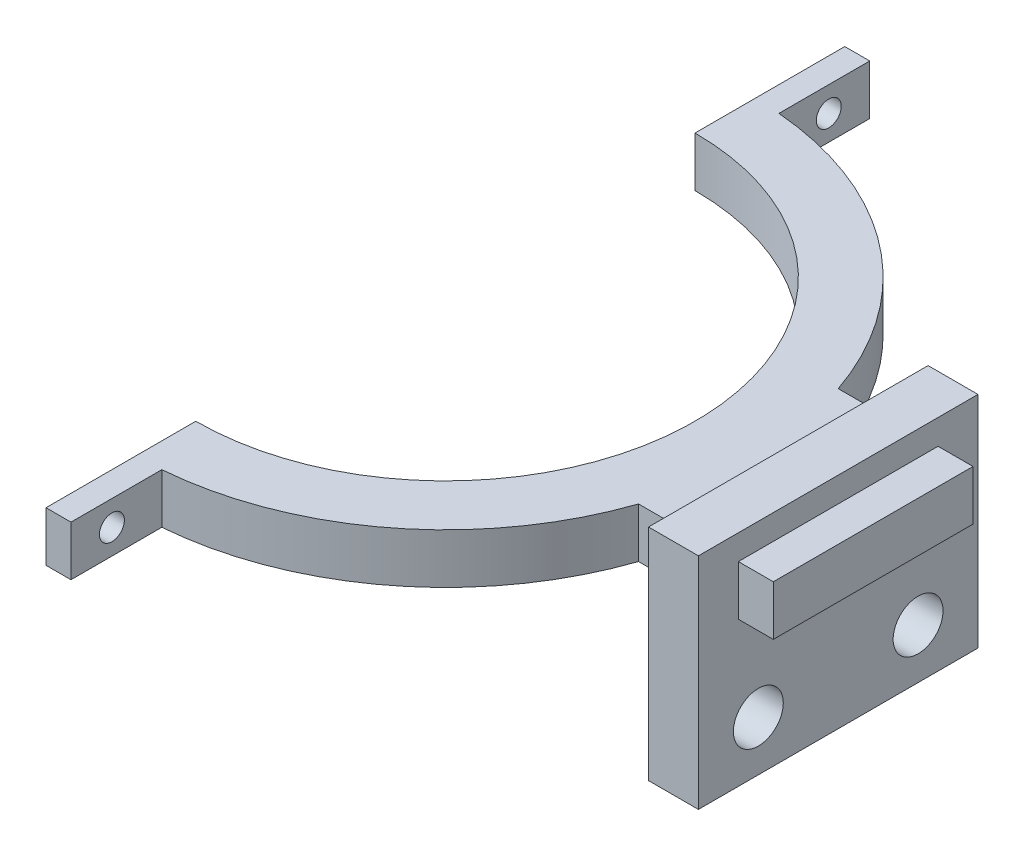
ISO-10303-21;
HEADER;
FILE_DESCRIPTION(('STEP AP214'),'2;1');
FILE_NAME('part.step','',(''),(''),'','','');
FILE_SCHEMA(('AUTOMOTIVE_DESIGN { 1 0 10303 214 1 1 1 1 }'));
ENDSEC;
DATA;
#1=APPLICATION_CONTEXT('core data for automotive mechanical design processes');
#2=APPLICATION_PROTOCOL_DEFINITION('international standard','automotive_design',2000,#1);
#3=PRODUCT_CONTEXT('',#1,'mechanical');
#4=PRODUCT('Part','Part','',(#3));
#5=PRODUCT_RELATED_PRODUCT_CATEGORY('part','',(#4));
#6=PRODUCT_DEFINITION_FORMATION('','',#4);
#7=PRODUCT_DEFINITION_CONTEXT('part definition',#1,'design');
#8=PRODUCT_DEFINITION('design','',#6,#7);
#9=PRODUCT_DEFINITION_SHAPE('','',#8);
#10=(LENGTH_UNIT() NAMED_UNIT(*) SI_UNIT(.MILLI.,.METRE.));
#11=(NAMED_UNIT(*) PLANE_ANGLE_UNIT() SI_UNIT($,.RADIAN.));
#12=(NAMED_UNIT(*) SI_UNIT($,.STERADIAN.) SOLID_ANGLE_UNIT());
#13=UNCERTAINTY_MEASURE_WITH_UNIT(LENGTH_MEASURE(1.E-05),#10,'distance_accuracy_value','');
#14=(GEOMETRIC_REPRESENTATION_CONTEXT(3) GLOBAL_UNCERTAINTY_ASSIGNED_CONTEXT((#13)) GLOBAL_UNIT_ASSIGNED_CONTEXT((#10,
#11,#12)) REPRESENTATION_CONTEXT('',''));
#15=CARTESIAN_POINT('',(0.,0.,0.));
#16=DIRECTION('',(0.,0.,1.));
#17=DIRECTION('',(1.,0.,0.));
#18=AXIS2_PLACEMENT_3D('',#15,#16,#17);
#19=CARTESIAN_POINT('',(39.3428015022424,5.,0.));
#20=DIRECTION('',(1.,0.,0.));
#21=DIRECTION('',(0.,0.,-1.));
#22=AXIS2_PLACEMENT_3D('',#19,#20,#21);
#23=PLANE('',#22);
#24=DIRECTION('',(0.,-1.,0.));
#25=VECTOR('',#24,1.);
#26=CARTESIAN_POINT('',(39.3428015022424,0.,-14.));
#27=LINE('',#26,#25);
#28=CARTESIAN_POINT('',(39.3428015022424,7.5,-14.));
#29=VERTEX_POINT('',#28);
#30=CARTESIAN_POINT('',(39.3428015022424,-14.5,-14.));
#31=VERTEX_POINT('',#30);
#32=EDGE_CURVE('E213',#29,#31,#27,.T.);
#33=ORIENTED_EDGE('',*,*,#32,.F.);
#34=DIRECTION('',(0.,0.,-1.));
#35=VECTOR('',#34,1.);
#36=CARTESIAN_POINT('',(39.3428015022424,7.5,0.));
#37=LINE('',#36,#35);
#38=CARTESIAN_POINT('',(39.3428015022424,7.5,14.));
#39=VERTEX_POINT('',#38);
#40=EDGE_CURVE('E216',#39,#29,#37,.T.);
#41=ORIENTED_EDGE('',*,*,#40,.F.);
#42=DIRECTION('',(0.,-1.,0.));
#43=VECTOR('',#42,1.);
#44=CARTESIAN_POINT('',(39.3428015022424,0.,14.));
#45=LINE('',#44,#43);
#46=CARTESIAN_POINT('',(39.3428015022424,-14.5,14.));
#47=VERTEX_POINT('',#46);
#48=EDGE_CURVE('E240',#39,#47,#45,.T.);
#49=ORIENTED_EDGE('',*,*,#48,.T.);
#50=DIRECTION('',(0.,0.,-1.));
#51=VECTOR('',#50,1.);
#52=CARTESIAN_POINT('',(39.3428015022424,-14.5,0.));
#53=LINE('',#52,#51);
#54=EDGE_CURVE('E243',#47,#31,#53,.T.);
#55=ORIENTED_EDGE('',*,*,#54,.T.);
#56=EDGE_LOOP('',(#33,#41,#49,#55));
#57=FACE_BOUND('',#56,.T.);
#58=CARTESIAN_POINT('',(39.3428015022424,-9.5,-8.));
#59=DIRECTION('',(1.,0.,0.));
#60=DIRECTION('',(0.,0.,-1.));
#61=AXIS2_PLACEMENT_3D('',#58,#59,#60);
#62=CIRCLE('',#61,2.5);
#63=CARTESIAN_POINT('',(39.3428015022424,-9.5,-10.5));
#64=VERTEX_POINT('',#63);
#65=EDGE_CURVE('E246',#64,#64,#62,.T.);
#66=ORIENTED_EDGE('',*,*,#65,.F.);
#67=EDGE_LOOP('',(#66));
#68=FACE_BOUND('',#67,.T.);
#69=CARTESIAN_POINT('',(39.3428015022424,-9.5,8.));
#70=DIRECTION('',(1.,0.,0.));
#71=DIRECTION('',(0.,0.,-1.));
#72=AXIS2_PLACEMENT_3D('',#69,#70,#71);
#73=CIRCLE('',#72,2.5);
#74=CARTESIAN_POINT('',(39.3428015022424,-9.5,5.5));
#75=VERTEX_POINT('',#74);
#76=EDGE_CURVE('E224',#75,#75,#73,.F.);
#77=ORIENTED_EDGE('',*,*,#76,.T.);
#78=EDGE_LOOP('',(#77));
#79=FACE_BOUND('',#78,.T.);
#80=DIRECTION('',(0.,0.,1.));
#81=VECTOR('',#80,1.);
#82=CARTESIAN_POINT('',(39.3428015022424,5.,10.));
#83=LINE('',#82,#81);
#84=CARTESIAN_POINT('',(39.3428015022424,5.,-10.));
#85=VERTEX_POINT('',#84);
#86=CARTESIAN_POINT('',(39.3428015022424,5.,10.));
#87=VERTEX_POINT('',#86);
#88=EDGE_CURVE('E483',#85,#87,#83,.T.);
#89=ORIENTED_EDGE('',*,*,#88,.F.);
#90=DIRECTION('',(0.,1.,0.));
#91=VECTOR('',#90,1.);
#92=CARTESIAN_POINT('',(39.3428015022424,5.,-10.));
#93=LINE('',#92,#91);
#94=CARTESIAN_POINT('',(39.3428015022424,0.,-10.));
#95=VERTEX_POINT('',#94);
#96=EDGE_CURVE('E211',#95,#85,#93,.T.);
#97=ORIENTED_EDGE('',*,*,#96,.F.);
#98=DIRECTION('',(0.,0.,-1.));
#99=VECTOR('',#98,1.);
#100=CARTESIAN_POINT('',(39.3428015022424,0.,10.));
#101=LINE('',#100,#99);
#102=CARTESIAN_POINT('',(39.3428015022424,0.,10.));
#103=VERTEX_POINT('',#102);
#104=EDGE_CURVE('E207',#103,#95,#101,.T.);
#105=ORIENTED_EDGE('',*,*,#104,.F.);
#106=DIRECTION('',(0.,-1.,0.));
#107=VECTOR('',#106,1.);
#108=CARTESIAN_POINT('',(39.3428015022424,5.,10.));
#109=LINE('',#108,#107);
#110=EDGE_CURVE('E485',#87,#103,#109,.T.);
#111=ORIENTED_EDGE('',*,*,#110,.F.);
#112=EDGE_LOOP('',(#89,#97,#105,#111));
#113=FACE_BOUND('',#112,.T.);
#114=ADVANCED_FACE('F50',(#57,#68,#79,#113),#23,.T.);
#115=CARTESIAN_POINT('',(0.,5.,-9.99999999999999));
#116=DIRECTION('',(0.,0.,1.));
#117=DIRECTION('',(1.,0.,0.));
#118=AXIS2_PLACEMENT_3D('',#115,#116,#117);
#119=PLANE('',#118);
#120=DIRECTION('',(0.,1.,0.));
#121=VECTOR('',#120,1.);
#122=CARTESIAN_POINT('',(34.3428015022424,5.,-10.));
#123=LINE('',#122,#121);
#124=CARTESIAN_POINT('',(34.3428015022424,0.,-10.));
#125=VERTEX_POINT('',#124);
#126=CARTESIAN_POINT('',(34.3428015022424,5.,-10.));
#127=VERTEX_POINT('',#126);
#128=EDGE_CURVE('E260',#125,#127,#123,.T.);
#129=ORIENTED_EDGE('',*,*,#128,.F.);
#130=DIRECTION('',(-1.,0.,0.));
#131=VECTOR('',#130,1.);
#132=CARTESIAN_POINT('',(0.,0.,-9.99999999999999));
#133=LINE('',#132,#131);
#134=CARTESIAN_POINT('',(29.3428015022424,0.,-10.));
#135=VERTEX_POINT('',#134);
#136=EDGE_CURVE('E265',#125,#135,#133,.T.);
#137=ORIENTED_EDGE('',*,*,#136,.T.);
#138=DIRECTION('',(0.,-1.,0.));
#139=VECTOR('',#138,1.);
#140=CARTESIAN_POINT('',(29.3428015022424,5.,-10.));
#141=LINE('',#140,#139);
#142=CARTESIAN_POINT('',(29.3428015022424,5.,-10.));
#143=VERTEX_POINT('',#142);
#144=EDGE_CURVE('E58',#143,#135,#141,.T.);
#145=ORIENTED_EDGE('',*,*,#144,.F.);
#146=DIRECTION('',(-1.,0.,0.));
#147=VECTOR('',#146,1.);
#148=CARTESIAN_POINT('',(0.,5.,-9.99999999999999));
#149=LINE('',#148,#147);
#150=EDGE_CURVE('E266',#127,#143,#149,.T.);
#151=ORIENTED_EDGE('',*,*,#150,.F.);
#152=EDGE_LOOP('',(#129,#137,#145,#151));
#153=FACE_BOUND('',#152,.T.);
#154=ADVANCED_FACE('F52',(#153),#119,.F.);
#155=CARTESIAN_POINT('',(0.,5.,10.));
#156=DIRECTION('',(0.,0.,1.));
#157=DIRECTION('',(1.,0.,0.));
#158=AXIS2_PLACEMENT_3D('',#155,#156,#157);
#159=PLANE('',#158);
#160=DIRECTION('',(-1.,0.,0.));
#161=VECTOR('',#160,1.);
#162=CARTESIAN_POINT('',(0.,0.,10.));
#163=LINE('',#162,#161);
#164=CARTESIAN_POINT('',(34.3428015022424,0.,10.));
#165=VERTEX_POINT('',#164);
#166=CARTESIAN_POINT('',(29.3428015022424,0.,10.));
#167=VERTEX_POINT('',#166);
#168=EDGE_CURVE('E269',#165,#167,#163,.T.);
#169=ORIENTED_EDGE('',*,*,#168,.F.);
#170=DIRECTION('',(0.,1.,0.));
#171=VECTOR('',#170,1.);
#172=CARTESIAN_POINT('',(34.3428015022424,5.,10.));
#173=LINE('',#172,#171);
#174=CARTESIAN_POINT('',(34.3428015022424,5.,10.));
#175=VERTEX_POINT('',#174);
#176=EDGE_CURVE('E73',#165,#175,#173,.T.);
#177=ORIENTED_EDGE('',*,*,#176,.T.);
#178=DIRECTION('',(-1.,0.,0.));
#179=VECTOR('',#178,1.);
#180=CARTESIAN_POINT('',(0.,5.,10.));
#181=LINE('',#180,#179);
#182=CARTESIAN_POINT('',(29.3428015022424,5.,10.));
#183=VERTEX_POINT('',#182);
#184=EDGE_CURVE('E292',#175,#183,#181,.T.);
#185=ORIENTED_EDGE('',*,*,#184,.T.);
#186=DIRECTION('',(0.,-1.,0.));
#187=VECTOR('',#186,1.);
#188=CARTESIAN_POINT('',(29.3428015022424,5.,10.));
#189=LINE('',#188,#187);
#190=EDGE_CURVE('E294',#183,#167,#189,.T.);
#191=ORIENTED_EDGE('',*,*,#190,.T.);
#192=EDGE_LOOP('',(#169,#177,#185,#191));
#193=FACE_BOUND('',#192,.T.);
#194=ADVANCED_FACE('F395',(#193),#159,.T.);
#195=CARTESIAN_POINT('',(0.,5.,0.));
#196=DIRECTION('',(0.,1.,0.));
#197=DIRECTION('',(0.,0.,1.));
#198=AXIS2_PLACEMENT_3D('',#195,#196,#197);
#199=PLANE('',#198);
#200=ORIENTED_EDGE('',*,*,#184,.F.);
#201=DIRECTION('',(0.,0.,-1.));
#202=VECTOR('',#201,1.);
#203=CARTESIAN_POINT('',(34.3428015022424,5.,0.));
#204=LINE('',#203,#202);
#205=EDGE_CURVE('E263',#175,#127,#204,.T.);
#206=ORIENTED_EDGE('',*,*,#205,.T.);
#207=ORIENTED_EDGE('',*,*,#150,.T.);
#208=CARTESIAN_POINT('',(0.,5.,0.));
#209=DIRECTION('',(0.,1.,0.));
#210=DIRECTION('',(0.,0.,1.));
#211=AXIS2_PLACEMENT_3D('',#208,#209,#210);
#212=CIRCLE('',#211,31.);
#213=CARTESIAN_POINT('',(2.5,5.,-30.8990291109608));
#214=VERTEX_POINT('',#213);
#215=EDGE_CURVE('E268',#143,#214,#212,.T.);
#216=ORIENTED_EDGE('',*,*,#215,.T.);
#217=DIRECTION('',(0.,0.,1.));
#218=VECTOR('',#217,1.);
#219=CARTESIAN_POINT('',(2.5,5.,0.));
#220=LINE('',#219,#218);
#221=CARTESIAN_POINT('',(2.5,5.,-40.));
#222=VERTEX_POINT('',#221);
#223=EDGE_CURVE('E271',#222,#214,#220,.T.);
#224=ORIENTED_EDGE('',*,*,#223,.F.);
#225=DIRECTION('',(1.,0.,0.));
#226=VECTOR('',#225,1.);
#227=CARTESIAN_POINT('',(0.,5.,-40.));
#228=LINE('',#227,#226);
#229=CARTESIAN_POINT('',(0.,5.,-40.));
#230=VERTEX_POINT('',#229);
#231=EDGE_CURVE('E274',#230,#222,#228,.T.);
#232=ORIENTED_EDGE('',*,*,#231,.F.);
#233=DIRECTION('',(0.,0.,-1.));
#234=VECTOR('',#233,1.);
#235=CARTESIAN_POINT('',(0.,5.,0.));
#236=LINE('',#235,#234);
#237=CARTESIAN_POINT('',(0.,5.,-25.));
#238=VERTEX_POINT('',#237);
#239=EDGE_CURVE('E277',#238,#230,#236,.T.);
#240=ORIENTED_EDGE('',*,*,#239,.F.);
#241=CARTESIAN_POINT('',(0.,5.,0.));
#242=DIRECTION('',(0.,1.,0.));
#243=DIRECTION('',(0.,0.,1.));
#244=AXIS2_PLACEMENT_3D('',#241,#242,#243);
#245=CIRCLE('',#244,25.);
#246=CARTESIAN_POINT('',(0.,5.,25.));
#247=VERTEX_POINT('',#246);
#248=EDGE_CURVE('E280',#247,#238,#245,.T.);
#249=ORIENTED_EDGE('',*,*,#248,.F.);
#250=DIRECTION('',(0.,0.,1.));
#251=VECTOR('',#250,1.);
#252=CARTESIAN_POINT('',(0.,5.,0.));
#253=LINE('',#252,#251);
#254=CARTESIAN_POINT('',(0.,5.,40.));
#255=VERTEX_POINT('',#254);
#256=EDGE_CURVE('E283',#247,#255,#253,.T.);
#257=ORIENTED_EDGE('',*,*,#256,.T.);
#258=DIRECTION('',(1.,0.,0.));
#259=VECTOR('',#258,1.);
#260=CARTESIAN_POINT('',(0.,5.,40.));
#261=LINE('',#260,#259);
#262=CARTESIAN_POINT('',(2.5,5.,40.));
#263=VERTEX_POINT('',#262);
#264=EDGE_CURVE('E285',#255,#263,#261,.T.);
#265=ORIENTED_EDGE('',*,*,#264,.T.);
#266=DIRECTION('',(0.,0.,-1.));
#267=VECTOR('',#266,1.);
#268=CARTESIAN_POINT('',(2.5,5.,0.));
#269=LINE('',#268,#267);
#270=CARTESIAN_POINT('',(2.5,5.,30.8990291109608));
#271=VERTEX_POINT('',#270);
#272=EDGE_CURVE('E287',#263,#271,#269,.T.);
#273=ORIENTED_EDGE('',*,*,#272,.T.);
#274=CARTESIAN_POINT('',(0.,5.,0.));
#275=DIRECTION('',(0.,1.,0.));
#276=DIRECTION('',(0.,0.,1.));
#277=AXIS2_PLACEMENT_3D('',#274,#275,#276);
#278=CIRCLE('',#277,31.);
#279=EDGE_CURVE('E289',#271,#183,#278,.T.);
#280=ORIENTED_EDGE('',*,*,#279,.T.);
#281=EDGE_LOOP('',(#200,#206,#207,#216,#224,#232,#240,#249,#257,#265,#273,#280));
#282=FACE_BOUND('',#281,.T.);
#283=ADVANCED_FACE('F360',(#282),#199,.T.);
#284=CARTESIAN_POINT('',(0.,0.,0.));
#285=DIRECTION('',(0.,1.,0.));
#286=DIRECTION('',(0.,0.,1.));
#287=AXIS2_PLACEMENT_3D('',#284,#285,#286);
#288=PLANE('',#287);
#289=DIRECTION('',(0.,0.,-1.));
#290=VECTOR('',#289,1.);
#291=CARTESIAN_POINT('',(34.3428015022424,0.,0.));
#292=LINE('',#291,#290);
#293=EDGE_CURVE('E13',#165,#125,#292,.T.);
#294=ORIENTED_EDGE('',*,*,#293,.F.);
#295=ORIENTED_EDGE('',*,*,#168,.T.);
#296=CARTESIAN_POINT('',(0.,0.,0.));
#297=DIRECTION('',(0.,1.,0.));
#298=DIRECTION('',(0.,0.,1.));
#299=AXIS2_PLACEMENT_3D('',#296,#297,#298);
#300=CIRCLE('',#299,31.);
#301=CARTESIAN_POINT('',(2.5,0.,30.8990291109608));
#302=VERTEX_POINT('',#301);
#303=EDGE_CURVE('E317',#302,#167,#300,.T.);
#304=ORIENTED_EDGE('',*,*,#303,.F.);
#305=DIRECTION('',(0.,0.,-1.));
#306=VECTOR('',#305,1.);
#307=CARTESIAN_POINT('',(2.5,0.,0.));
#308=LINE('',#307,#306);
#309=CARTESIAN_POINT('',(2.5,0.,40.));
#310=VERTEX_POINT('',#309);
#311=EDGE_CURVE('E315',#310,#302,#308,.T.);
#312=ORIENTED_EDGE('',*,*,#311,.F.);
#313=DIRECTION('',(1.,0.,0.));
#314=VECTOR('',#313,1.);
#315=CARTESIAN_POINT('',(0.,0.,40.));
#316=LINE('',#315,#314);
#317=CARTESIAN_POINT('',(0.,0.,40.));
#318=VERTEX_POINT('',#317);
#319=EDGE_CURVE('E313',#318,#310,#316,.T.);
#320=ORIENTED_EDGE('',*,*,#319,.F.);
#321=DIRECTION('',(0.,0.,1.));
#322=VECTOR('',#321,1.);
#323=CARTESIAN_POINT('',(0.,0.,0.));
#324=LINE('',#323,#322);
#325=CARTESIAN_POINT('',(0.,0.,25.));
#326=VERTEX_POINT('',#325);
#327=EDGE_CURVE('E311',#326,#318,#324,.T.);
#328=ORIENTED_EDGE('',*,*,#327,.F.);
#329=CARTESIAN_POINT('',(0.,0.,0.));
#330=DIRECTION('',(0.,1.,0.));
#331=DIRECTION('',(0.,0.,1.));
#332=AXIS2_PLACEMENT_3D('',#329,#330,#331);
#333=CIRCLE('',#332,25.);
#334=CARTESIAN_POINT('',(0.,0.,-25.));
#335=VERTEX_POINT('',#334);
#336=EDGE_CURVE('E308',#326,#335,#333,.T.);
#337=ORIENTED_EDGE('',*,*,#336,.T.);
#338=DIRECTION('',(0.,0.,-1.));
#339=VECTOR('',#338,1.);
#340=CARTESIAN_POINT('',(0.,0.,0.));
#341=LINE('',#340,#339);
#342=CARTESIAN_POINT('',(0.,0.,-40.));
#343=VERTEX_POINT('',#342);
#344=EDGE_CURVE('E305',#335,#343,#341,.T.);
#345=ORIENTED_EDGE('',*,*,#344,.T.);
#346=DIRECTION('',(1.,0.,0.));
#347=VECTOR('',#346,1.);
#348=CARTESIAN_POINT('',(0.,0.,-40.));
#349=LINE('',#348,#347);
#350=CARTESIAN_POINT('',(2.5,0.,-40.));
#351=VERTEX_POINT('',#350);
#352=EDGE_CURVE('E302',#343,#351,#349,.T.);
#353=ORIENTED_EDGE('',*,*,#352,.T.);
#354=DIRECTION('',(0.,0.,1.));
#355=VECTOR('',#354,1.);
#356=CARTESIAN_POINT('',(2.5,0.,0.));
#357=LINE('',#356,#355);
#358=CARTESIAN_POINT('',(2.5,0.,-30.8990291109608));
#359=VERTEX_POINT('',#358);
#360=EDGE_CURVE('E299',#351,#359,#357,.T.);
#361=ORIENTED_EDGE('',*,*,#360,.T.);
#362=CARTESIAN_POINT('',(0.,0.,0.));
#363=DIRECTION('',(0.,1.,0.));
#364=DIRECTION('',(0.,0.,1.));
#365=AXIS2_PLACEMENT_3D('',#362,#363,#364);
#366=CIRCLE('',#365,31.);
#367=EDGE_CURVE('E296',#135,#359,#366,.T.);
#368=ORIENTED_EDGE('',*,*,#367,.F.);
#369=ORIENTED_EDGE('',*,*,#136,.F.);
#370=EDGE_LOOP('',(#294,#295,#304,#312,#320,#328,#337,#345,#353,#361,#368,#369));
#371=FACE_BOUND('',#370,.T.);
#372=ADVANCED_FACE('F352',(#371),#288,.F.);
#373=CARTESIAN_POINT('',(0.,5.,0.));
#374=DIRECTION('',(0.,-1.,0.));
#375=DIRECTION('',(0.,0.,-1.));
#376=AXIS2_PLACEMENT_3D('',#373,#374,#375);
#377=CYLINDRICAL_SURFACE('',#376,31.);
#378=ORIENTED_EDGE('',*,*,#367,.T.);
#379=DIRECTION('',(0.,-1.,0.));
#380=VECTOR('',#379,1.);
#381=CARTESIAN_POINT('',(2.5,5.,-30.8990291109608));
#382=LINE('',#381,#380);
#383=EDGE_CURVE('E340',#214,#359,#382,.T.);
#384=ORIENTED_EDGE('',*,*,#383,.F.);
#385=ORIENTED_EDGE('',*,*,#215,.F.);
#386=ORIENTED_EDGE('',*,*,#144,.T.);
#387=EDGE_LOOP('',(#378,#384,#385,#386));
#388=FACE_BOUND('',#387,.T.);
#389=ADVANCED_FACE('F345',(#388),#377,.T.);
#390=CARTESIAN_POINT('',(2.5,5.,0.));
#391=DIRECTION('',(1.,0.,0.));
#392=DIRECTION('',(0.,0.,-1.));
#393=AXIS2_PLACEMENT_3D('',#390,#391,#392);
#394=PLANE('',#393);
#395=CARTESIAN_POINT('',(2.5,2.5,-35.8990291109608));
#396=DIRECTION('',(1.,0.,0.));
#397=DIRECTION('',(0.,0.,1.));
#398=AXIS2_PLACEMENT_3D('',#395,#396,#397);
#399=CIRCLE('',#398,1.25);
#400=CARTESIAN_POINT('',(2.5,2.5,-34.6490291109608));
#401=VERTEX_POINT('',#400);
#402=EDGE_CURVE('E474',#401,#401,#399,.T.);
#403=ORIENTED_EDGE('',*,*,#402,.F.);
#404=EDGE_LOOP('',(#403));
#405=FACE_BOUND('',#404,.T.);
#406=ORIENTED_EDGE('',*,*,#360,.F.);
#407=DIRECTION('',(0.,-1.,0.));
#408=VECTOR('',#407,1.);
#409=CARTESIAN_POINT('',(2.5,5.,-40.));
#410=LINE('',#409,#408);
#411=EDGE_CURVE('E338',#222,#351,#410,.T.);
#412=ORIENTED_EDGE('',*,*,#411,.F.);
#413=ORIENTED_EDGE('',*,*,#223,.T.);
#414=ORIENTED_EDGE('',*,*,#383,.T.);
#415=EDGE_LOOP('',(#406,#412,#413,#414));
#416=FACE_BOUND('',#415,.T.);
#417=ADVANCED_FACE('F356',(#405,#416),#394,.T.);
#418=CARTESIAN_POINT('',(0.,5.,-40.));
#419=DIRECTION('',(0.,0.,-1.));
#420=DIRECTION('',(-1.,0.,0.));
#421=AXIS2_PLACEMENT_3D('',#418,#419,#420);
#422=PLANE('',#421);
#423=ORIENTED_EDGE('',*,*,#352,.F.);
#424=DIRECTION('',(0.,-1.,0.));
#425=VECTOR('',#424,1.);
#426=CARTESIAN_POINT('',(0.,5.,-40.));
#427=LINE('',#426,#425);
#428=EDGE_CURVE('E336',#230,#343,#427,.T.);
#429=ORIENTED_EDGE('',*,*,#428,.F.);
#430=ORIENTED_EDGE('',*,*,#231,.T.);
#431=ORIENTED_EDGE('',*,*,#411,.T.);
#432=EDGE_LOOP('',(#423,#429,#430,#431));
#433=FACE_BOUND('',#432,.T.);
#434=ADVANCED_FACE('F363',(#433),#422,.T.);
#435=CARTESIAN_POINT('',(0.,5.,0.));
#436=DIRECTION('',(-1.,0.,0.));
#437=DIRECTION('',(0.,0.,1.));
#438=AXIS2_PLACEMENT_3D('',#435,#436,#437);
#439=PLANE('',#438);
#440=CARTESIAN_POINT('',(0.,2.5,-35.8990291109608));
#441=DIRECTION('',(1.,0.,0.));
#442=DIRECTION('',(0.,0.,1.));
#443=AXIS2_PLACEMENT_3D('',#440,#441,#442);
#444=CIRCLE('',#443,1.25);
#445=CARTESIAN_POINT('',(0.,2.5,-34.6490291109608));
#446=VERTEX_POINT('',#445);
#447=EDGE_CURVE('E470',#446,#446,#444,.T.);
#448=ORIENTED_EDGE('',*,*,#447,.T.);
#449=EDGE_LOOP('',(#448));
#450=FACE_BOUND('',#449,.T.);
#451=ORIENTED_EDGE('',*,*,#344,.F.);
#452=DIRECTION('',(0.,-1.,0.));
#453=VECTOR('',#452,1.);
#454=CARTESIAN_POINT('',(0.,5.,-25.));
#455=LINE('',#454,#453);
#456=EDGE_CURVE('E334',#238,#335,#455,.T.);
#457=ORIENTED_EDGE('',*,*,#456,.F.);
#458=ORIENTED_EDGE('',*,*,#239,.T.);
#459=ORIENTED_EDGE('',*,*,#428,.T.);
#460=EDGE_LOOP('',(#451,#457,#458,#459));
#461=FACE_BOUND('',#460,.T.);
#462=ADVANCED_FACE('F366',(#450,#461),#439,.T.);
#463=CARTESIAN_POINT('',(0.,5.,0.));
#464=DIRECTION('',(0.,-1.,0.));
#465=DIRECTION('',(0.,0.,-1.));
#466=AXIS2_PLACEMENT_3D('',#463,#464,#465);
#467=CYLINDRICAL_SURFACE('',#466,25.);
#468=ORIENTED_EDGE('',*,*,#336,.F.);
#469=DIRECTION('',(0.,-1.,0.));
#470=VECTOR('',#469,1.);
#471=CARTESIAN_POINT('',(0.,5.,25.));
#472=LINE('',#471,#470);
#473=EDGE_CURVE('E332',#247,#326,#472,.T.);
#474=ORIENTED_EDGE('',*,*,#473,.F.);
#475=ORIENTED_EDGE('',*,*,#248,.T.);
#476=ORIENTED_EDGE('',*,*,#456,.T.);
#477=EDGE_LOOP('',(#468,#474,#475,#476));
#478=FACE_BOUND('',#477,.T.);
#479=ADVANCED_FACE('F370',(#478),#467,.F.);
#480=CARTESIAN_POINT('',(0.,5.,0.));
#481=DIRECTION('',(1.,0.,0.));
#482=DIRECTION('',(0.,0.,-1.));
#483=AXIS2_PLACEMENT_3D('',#480,#481,#482);
#484=PLANE('',#483);
#485=CARTESIAN_POINT('',(0.,2.5,35.8990291109608));
#486=DIRECTION('',(1.,0.,0.));
#487=DIRECTION('',(0.,0.,-1.));
#488=AXIS2_PLACEMENT_3D('',#485,#486,#487);
#489=CIRCLE('',#488,1.25);
#490=CARTESIAN_POINT('',(0.,2.5,34.6490291109608));
#491=VERTEX_POINT('',#490);
#492=EDGE_CURVE('E465',#491,#491,#489,.T.);
#493=ORIENTED_EDGE('',*,*,#492,.T.);
#494=EDGE_LOOP('',(#493));
#495=FACE_BOUND('',#494,.T.);
#496=ORIENTED_EDGE('',*,*,#327,.T.);
#497=DIRECTION('',(0.,-1.,0.));
#498=VECTOR('',#497,1.);
#499=CARTESIAN_POINT('',(0.,5.,40.));
#500=LINE('',#499,#498);
#501=EDGE_CURVE('E329',#255,#318,#500,.T.);
#502=ORIENTED_EDGE('',*,*,#501,.F.);
#503=ORIENTED_EDGE('',*,*,#256,.F.);
#504=ORIENTED_EDGE('',*,*,#473,.T.);
#505=EDGE_LOOP('',(#496,#502,#503,#504));
#506=FACE_BOUND('',#505,.T.);
#507=ADVANCED_FACE('F375',(#495,#506),#484,.F.);
#508=CARTESIAN_POINT('',(0.,5.,40.));
#509=DIRECTION('',(0.,0.,-1.));
#510=DIRECTION('',(-1.,0.,0.));
#511=AXIS2_PLACEMENT_3D('',#508,#509,#510);
#512=PLANE('',#511);
#513=ORIENTED_EDGE('',*,*,#319,.T.);
#514=DIRECTION('',(0.,-1.,0.));
#515=VECTOR('',#514,1.);
#516=CARTESIAN_POINT('',(2.5,5.,40.));
#517=LINE('',#516,#515);
#518=EDGE_CURVE('E326',#263,#310,#517,.T.);
#519=ORIENTED_EDGE('',*,*,#518,.F.);
#520=ORIENTED_EDGE('',*,*,#264,.F.);
#521=ORIENTED_EDGE('',*,*,#501,.T.);
#522=EDGE_LOOP('',(#513,#519,#520,#521));
#523=FACE_BOUND('',#522,.T.);
#524=ADVANCED_FACE('F381',(#523),#512,.F.);
#525=CARTESIAN_POINT('',(2.5,5.,0.));
#526=DIRECTION('',(-1.,0.,0.));
#527=DIRECTION('',(0.,0.,1.));
#528=AXIS2_PLACEMENT_3D('',#525,#526,#527);
#529=PLANE('',#528);
#530=CARTESIAN_POINT('',(2.5,2.5,35.8990291109608));
#531=DIRECTION('',(1.,0.,0.));
#532=DIRECTION('',(0.,0.,-1.));
#533=AXIS2_PLACEMENT_3D('',#530,#531,#532);
#534=CIRCLE('',#533,1.25);
#535=CARTESIAN_POINT('',(2.5,2.5,34.6490291109608));
#536=VERTEX_POINT('',#535);
#537=EDGE_CURVE('E468',#536,#536,#534,.T.);
#538=ORIENTED_EDGE('',*,*,#537,.F.);
#539=EDGE_LOOP('',(#538));
#540=FACE_BOUND('',#539,.T.);
#541=ORIENTED_EDGE('',*,*,#311,.T.);
#542=DIRECTION('',(0.,-1.,0.));
#543=VECTOR('',#542,1.);
#544=CARTESIAN_POINT('',(2.5,5.,30.8990291109608));
#545=LINE('',#544,#543);
#546=EDGE_CURVE('E323',#271,#302,#545,.T.);
#547=ORIENTED_EDGE('',*,*,#546,.F.);
#548=ORIENTED_EDGE('',*,*,#272,.F.);
#549=ORIENTED_EDGE('',*,*,#518,.T.);
#550=EDGE_LOOP('',(#541,#547,#548,#549));
#551=FACE_BOUND('',#550,.T.);
#552=ADVANCED_FACE('F385',(#540,#551),#529,.F.);
#553=CARTESIAN_POINT('',(0.,5.,0.));
#554=DIRECTION('',(0.,-1.,0.));
#555=DIRECTION('',(0.,0.,-1.));
#556=AXIS2_PLACEMENT_3D('',#553,#554,#555);
#557=CYLINDRICAL_SURFACE('',#556,31.);
#558=ORIENTED_EDGE('',*,*,#303,.T.);
#559=ORIENTED_EDGE('',*,*,#190,.F.);
#560=ORIENTED_EDGE('',*,*,#279,.F.);
#561=ORIENTED_EDGE('',*,*,#546,.T.);
#562=EDGE_LOOP('',(#558,#559,#560,#561));
#563=FACE_BOUND('',#562,.T.);
#564=ADVANCED_FACE('F390',(#563),#557,.T.);
#565=CARTESIAN_POINT('',(34.3428015022424,0.,-14.));
#566=DIRECTION('',(0.,0.,1.));
#567=DIRECTION('',(0.,-1.,0.));
#568=AXIS2_PLACEMENT_3D('',#565,#566,#567);
#569=PLANE('',#568);
#570=ORIENTED_EDGE('',*,*,#32,.T.);
#571=DIRECTION('',(1.,0.,0.));
#572=VECTOR('',#571,1.);
#573=CARTESIAN_POINT('',(34.3428015022424,-14.5,-14.));
#574=LINE('',#573,#572);
#575=CARTESIAN_POINT('',(34.3428015022424,-14.5,-14.));
#576=VERTEX_POINT('',#575);
#577=EDGE_CURVE('E251',#576,#31,#574,.T.);
#578=ORIENTED_EDGE('',*,*,#577,.F.);
#579=DIRECTION('',(0.,-1.,0.));
#580=VECTOR('',#579,1.);
#581=CARTESIAN_POINT('',(34.3428015022424,0.,-14.));
#582=LINE('',#581,#580);
#583=CARTESIAN_POINT('',(34.3428015022424,7.5,-14.));
#584=VERTEX_POINT('',#583);
#585=EDGE_CURVE('E221',#584,#576,#582,.T.);
#586=ORIENTED_EDGE('',*,*,#585,.F.);
#587=DIRECTION('',(1.,0.,0.));
#588=VECTOR('',#587,1.);
#589=CARTESIAN_POINT('',(34.3428015022424,7.5,-14.));
#590=LINE('',#589,#588);
#591=EDGE_CURVE('E237',#584,#29,#590,.T.);
#592=ORIENTED_EDGE('',*,*,#591,.T.);
#593=EDGE_LOOP('',(#570,#578,#586,#592));
#594=FACE_BOUND('',#593,.T.);
#595=ADVANCED_FACE('F414',(#594),#569,.F.);
#596=CARTESIAN_POINT('',(34.3428015022424,-14.5,0.));
#597=DIRECTION('',(0.,-1.,0.));
#598=DIRECTION('',(0.,0.,-1.));
#599=AXIS2_PLACEMENT_3D('',#596,#597,#598);
#600=PLANE('',#599);
#601=ORIENTED_EDGE('',*,*,#54,.F.);
#602=DIRECTION('',(1.,0.,0.));
#603=VECTOR('',#602,1.);
#604=CARTESIAN_POINT('',(34.3428015022424,-14.5,14.));
#605=LINE('',#604,#603);
#606=CARTESIAN_POINT('',(34.3428015022424,-14.5,14.));
#607=VERTEX_POINT('',#606);
#608=EDGE_CURVE('E253',#607,#47,#605,.T.);
#609=ORIENTED_EDGE('',*,*,#608,.F.);
#610=DIRECTION('',(0.,0.,-1.));
#611=VECTOR('',#610,1.);
#612=CARTESIAN_POINT('',(34.3428015022424,-14.5,0.));
#613=LINE('',#612,#611);
#614=EDGE_CURVE('E229',#607,#576,#613,.T.);
#615=ORIENTED_EDGE('',*,*,#614,.T.);
#616=ORIENTED_EDGE('',*,*,#577,.T.);
#617=EDGE_LOOP('',(#601,#609,#615,#616));
#618=FACE_BOUND('',#617,.T.);
#619=ADVANCED_FACE('F417',(#618),#600,.T.);
#620=CARTESIAN_POINT('',(34.3428015022424,0.,14.));
#621=DIRECTION('',(0.,0.,1.));
#622=DIRECTION('',(0.,-1.,0.));
#623=AXIS2_PLACEMENT_3D('',#620,#621,#622);
#624=PLANE('',#623);
#625=ORIENTED_EDGE('',*,*,#48,.F.);
#626=DIRECTION('',(1.,0.,0.));
#627=VECTOR('',#626,1.);
#628=CARTESIAN_POINT('',(34.3428015022424,7.5,14.));
#629=LINE('',#628,#627);
#630=CARTESIAN_POINT('',(34.3428015022424,7.5,14.));
#631=VERTEX_POINT('',#630);
#632=EDGE_CURVE('E255',#631,#39,#629,.T.);
#633=ORIENTED_EDGE('',*,*,#632,.F.);
#634=DIRECTION('',(0.,-1.,0.));
#635=VECTOR('',#634,1.);
#636=CARTESIAN_POINT('',(34.3428015022424,0.,14.));
#637=LINE('',#636,#635);
#638=EDGE_CURVE('E226',#631,#607,#637,.T.);
#639=ORIENTED_EDGE('',*,*,#638,.T.);
#640=ORIENTED_EDGE('',*,*,#608,.T.);
#641=EDGE_LOOP('',(#625,#633,#639,#640));
#642=FACE_BOUND('',#641,.T.);
#643=ADVANCED_FACE('F425',(#642),#624,.T.);
#644=CARTESIAN_POINT('',(34.3428015022424,-9.5,-8.));
#645=DIRECTION('',(1.,0.,0.));
#646=DIRECTION('',(0.,0.,-1.));
#647=AXIS2_PLACEMENT_3D('',#644,#645,#646);
#648=CYLINDRICAL_SURFACE('',#647,2.5);
#649=CARTESIAN_POINT('',(34.3428015022424,-9.5,-8.));
#650=DIRECTION('',(1.,0.,0.));
#651=DIRECTION('',(0.,0.,-1.));
#652=AXIS2_PLACEMENT_3D('',#649,#650,#651);
#653=CIRCLE('',#652,2.5);
#654=CARTESIAN_POINT('',(34.3428015022424,-9.5,-10.5));
#655=VERTEX_POINT('',#654);
#656=EDGE_CURVE('E232',#655,#655,#653,.T.);
#657=ORIENTED_EDGE('',*,*,#656,.F.);
#658=EDGE_LOOP('',(#657));
#659=FACE_BOUND('',#658,.T.);
#660=ORIENTED_EDGE('',*,*,#65,.T.);
#661=EDGE_LOOP('',(#660));
#662=FACE_BOUND('',#661,.T.);
#663=ADVANCED_FACE('F423',(#659,#662),#648,.F.);
#664=CARTESIAN_POINT('',(34.3428015022424,7.5,0.));
#665=DIRECTION('',(0.,-1.,0.));
#666=DIRECTION('',(0.,0.,-1.));
#667=AXIS2_PLACEMENT_3D('',#664,#665,#666);
#668=PLANE('',#667);
#669=ORIENTED_EDGE('',*,*,#40,.T.);
#670=ORIENTED_EDGE('',*,*,#591,.F.);
#671=DIRECTION('',(0.,0.,-1.));
#672=VECTOR('',#671,1.);
#673=CARTESIAN_POINT('',(34.3428015022424,7.5,0.));
#674=LINE('',#673,#672);
#675=EDGE_CURVE('E223',#631,#584,#674,.T.);
#676=ORIENTED_EDGE('',*,*,#675,.F.);
#677=ORIENTED_EDGE('',*,*,#632,.T.);
#678=EDGE_LOOP('',(#669,#670,#676,#677));
#679=FACE_BOUND('',#678,.T.);
#680=ADVANCED_FACE('F419',(#679),#668,.F.);
#681=CARTESIAN_POINT('',(34.3428015022424,-9.5,8.));
#682=DIRECTION('',(1.,0.,0.));
#683=DIRECTION('',(0.,0.,-1.));
#684=AXIS2_PLACEMENT_3D('',#681,#682,#683);
#685=CYLINDRICAL_SURFACE('',#684,2.5);
#686=CARTESIAN_POINT('',(34.3428015022424,-9.5,8.));
#687=DIRECTION('',(1.,0.,0.));
#688=DIRECTION('',(0.,0.,-1.));
#689=AXIS2_PLACEMENT_3D('',#686,#687,#688);
#690=CIRCLE('',#689,2.5);
#691=CARTESIAN_POINT('',(34.3428015022424,-9.5,5.5));
#692=VERTEX_POINT('',#691);
#693=EDGE_CURVE('E235',#692,#692,#690,.F.);
#694=ORIENTED_EDGE('',*,*,#693,.T.);
#695=EDGE_LOOP('',(#694));
#696=FACE_BOUND('',#695,.T.);
#697=ORIENTED_EDGE('',*,*,#76,.F.);
#698=EDGE_LOOP('',(#697));
#699=FACE_BOUND('',#698,.T.);
#700=ADVANCED_FACE('F422',(#696,#699),#685,.F.);
#701=CARTESIAN_POINT('',(34.3428015022424,0.,0.));
#702=DIRECTION('',(1.,0.,0.));
#703=DIRECTION('',(0.,0.,-1.));
#704=AXIS2_PLACEMENT_3D('',#701,#702,#703);
#705=PLANE('',#704);
#706=ORIENTED_EDGE('',*,*,#205,.F.);
#707=ORIENTED_EDGE('',*,*,#176,.F.);
#708=ORIENTED_EDGE('',*,*,#293,.T.);
#709=ORIENTED_EDGE('',*,*,#128,.T.);
#710=EDGE_LOOP('',(#706,#707,#708,#709));
#711=FACE_BOUND('',#710,.T.);
#712=ORIENTED_EDGE('',*,*,#585,.T.);
#713=ORIENTED_EDGE('',*,*,#614,.F.);
#714=ORIENTED_EDGE('',*,*,#638,.F.);
#715=ORIENTED_EDGE('',*,*,#675,.T.);
#716=EDGE_LOOP('',(#712,#713,#714,#715));
#717=FACE_BOUND('',#716,.T.);
#718=ORIENTED_EDGE('',*,*,#656,.T.);
#719=EDGE_LOOP('',(#718));
#720=FACE_BOUND('',#719,.T.);
#721=ORIENTED_EDGE('',*,*,#693,.F.);
#722=EDGE_LOOP('',(#721));
#723=FACE_BOUND('',#722,.T.);
#724=ADVANCED_FACE('F393',(#711,#717,#720,#723),#705,.F.);
#725=CARTESIAN_POINT('',(42.8428015022424,5.,-10.));
#726=DIRECTION('',(0.,0.,1.));
#727=DIRECTION('',(1.,0.,0.));
#728=AXIS2_PLACEMENT_3D('',#725,#726,#727);
#729=PLANE('',#728);
#730=ORIENTED_EDGE('',*,*,#96,.T.);
#731=DIRECTION('',(-1.,0.,0.));
#732=VECTOR('',#731,1.);
#733=CARTESIAN_POINT('',(42.8428015022424,5.,-10.));
#734=LINE('',#733,#732);
#735=CARTESIAN_POINT('',(42.8428015022424,5.,-10.));
#736=VERTEX_POINT('',#735);
#737=EDGE_CURVE('E192',#736,#85,#734,.T.);
#738=ORIENTED_EDGE('',*,*,#737,.F.);
#739=DIRECTION('',(0.,1.,0.));
#740=VECTOR('',#739,1.);
#741=CARTESIAN_POINT('',(42.8428015022424,5.,-10.));
#742=LINE('',#741,#740);
#743=CARTESIAN_POINT('',(42.8428015022424,0.,-10.));
#744=VERTEX_POINT('',#743);
#745=EDGE_CURVE('E199',#744,#736,#742,.T.);
#746=ORIENTED_EDGE('',*,*,#745,.F.);
#747=DIRECTION('',(-1.,0.,0.));
#748=VECTOR('',#747,1.);
#749=CARTESIAN_POINT('',(42.8428015022424,0.,-10.));
#750=LINE('',#749,#748);
#751=EDGE_CURVE('E481',#744,#95,#750,.T.);
#752=ORIENTED_EDGE('',*,*,#751,.T.);
#753=EDGE_LOOP('',(#730,#738,#746,#752));
#754=FACE_BOUND('',#753,.T.);
#755=ADVANCED_FACE('F209',(#754),#729,.F.);
#756=CARTESIAN_POINT('',(42.8428015022424,5.,10.));
#757=DIRECTION('',(0.,-1.,0.));
#758=DIRECTION('',(0.,0.,-1.));
#759=AXIS2_PLACEMENT_3D('',#756,#757,#758);
#760=PLANE('',#759);
#761=ORIENTED_EDGE('',*,*,#88,.T.);
#762=DIRECTION('',(-1.,0.,0.));
#763=VECTOR('',#762,1.);
#764=CARTESIAN_POINT('',(42.8428015022424,5.,10.));
#765=LINE('',#764,#763);
#766=CARTESIAN_POINT('',(42.8428015022424,5.,10.));
#767=VERTEX_POINT('',#766);
#768=EDGE_CURVE('E195',#767,#87,#765,.T.);
#769=ORIENTED_EDGE('',*,*,#768,.F.);
#770=DIRECTION('',(0.,0.,1.));
#771=VECTOR('',#770,1.);
#772=CARTESIAN_POINT('',(42.8428015022424,5.,10.));
#773=LINE('',#772,#771);
#774=EDGE_CURVE('E188',#736,#767,#773,.T.);
#775=ORIENTED_EDGE('',*,*,#774,.F.);
#776=ORIENTED_EDGE('',*,*,#737,.T.);
#777=EDGE_LOOP('',(#761,#769,#775,#776));
#778=FACE_BOUND('',#777,.T.);
#779=ADVANCED_FACE('F190',(#778),#760,.F.);
#780=CARTESIAN_POINT('',(42.8428015022424,5.,10.));
#781=DIRECTION('',(0.,0.,-1.));
#782=DIRECTION('',(-1.,0.,0.));
#783=AXIS2_PLACEMENT_3D('',#780,#781,#782);
#784=PLANE('',#783);
#785=ORIENTED_EDGE('',*,*,#110,.T.);
#786=DIRECTION('',(-1.,0.,0.));
#787=VECTOR('',#786,1.);
#788=CARTESIAN_POINT('',(42.8428015022424,0.,10.));
#789=LINE('',#788,#787);
#790=CARTESIAN_POINT('',(42.8428015022424,0.,10.));
#791=VERTEX_POINT('',#790);
#792=EDGE_CURVE('E65',#791,#103,#789,.T.);
#793=ORIENTED_EDGE('',*,*,#792,.F.);
#794=DIRECTION('',(0.,-1.,0.));
#795=VECTOR('',#794,1.);
#796=CARTESIAN_POINT('',(42.8428015022424,5.,10.));
#797=LINE('',#796,#795);
#798=EDGE_CURVE('E198',#767,#791,#797,.T.);
#799=ORIENTED_EDGE('',*,*,#798,.F.);
#800=ORIENTED_EDGE('',*,*,#768,.T.);
#801=EDGE_LOOP('',(#785,#793,#799,#800));
#802=FACE_BOUND('',#801,.T.);
#803=ADVANCED_FACE('F444',(#802),#784,.F.);
#804=CARTESIAN_POINT('',(42.8428015022424,0.,10.));
#805=DIRECTION('',(0.,1.,0.));
#806=DIRECTION('',(0.,0.,1.));
#807=AXIS2_PLACEMENT_3D('',#804,#805,#806);
#808=PLANE('',#807);
#809=ORIENTED_EDGE('',*,*,#104,.T.);
#810=ORIENTED_EDGE('',*,*,#751,.F.);
#811=DIRECTION('',(0.,0.,-1.));
#812=VECTOR('',#811,1.);
#813=CARTESIAN_POINT('',(42.8428015022424,0.,10.));
#814=LINE('',#813,#812);
#815=EDGE_CURVE('E203',#791,#744,#814,.T.);
#816=ORIENTED_EDGE('',*,*,#815,.F.);
#817=ORIENTED_EDGE('',*,*,#792,.T.);
#818=EDGE_LOOP('',(#809,#810,#816,#817));
#819=FACE_BOUND('',#818,.T.);
#820=ADVANCED_FACE('F447',(#819),#808,.F.);
#821=CARTESIAN_POINT('',(42.8428015022424,0.,0.));
#822=DIRECTION('',(1.,0.,0.));
#823=DIRECTION('',(0.,0.,-1.));
#824=AXIS2_PLACEMENT_3D('',#821,#822,#823);
#825=PLANE('',#824);
#826=ORIENTED_EDGE('',*,*,#745,.T.);
#827=ORIENTED_EDGE('',*,*,#774,.T.);
#828=ORIENTED_EDGE('',*,*,#798,.T.);
#829=ORIENTED_EDGE('',*,*,#815,.T.);
#830=EDGE_LOOP('',(#826,#827,#828,#829));
#831=FACE_BOUND('',#830,.T.);
#832=ADVANCED_FACE('F202',(#831),#825,.T.);
#833=CARTESIAN_POINT('',(0.,2.5,35.8990291109608));
#834=DIRECTION('',(1.,0.,0.));
#835=DIRECTION('',(0.,0.,-1.));
#836=AXIS2_PLACEMENT_3D('',#833,#834,#835);
#837=CYLINDRICAL_SURFACE('',#836,1.25);
#838=ORIENTED_EDGE('',*,*,#492,.F.);
#839=EDGE_LOOP('',(#838));
#840=FACE_BOUND('',#839,.T.);
#841=ORIENTED_EDGE('',*,*,#537,.T.);
#842=EDGE_LOOP('',(#841));
#843=FACE_BOUND('',#842,.T.);
#844=ADVANCED_FACE('F453',(#840,#843),#837,.F.);
#845=CARTESIAN_POINT('',(0.,2.5,-35.8990291109608));
#846=DIRECTION('',(1.,0.,0.));
#847=DIRECTION('',(0.,0.,-1.));
#848=AXIS2_PLACEMENT_3D('',#845,#846,#847);
#849=CYLINDRICAL_SURFACE('',#848,1.25);
#850=ORIENTED_EDGE('',*,*,#447,.F.);
#851=EDGE_LOOP('',(#850));
#852=FACE_BOUND('',#851,.T.);
#853=ORIENTED_EDGE('',*,*,#402,.T.);
#854=EDGE_LOOP('',(#853));
#855=FACE_BOUND('',#854,.T.);
#856=ADVANCED_FACE('F454',(#852,#855),#849,.F.);
#857=CLOSED_SHELL('',(#114,#154,#194,#283,#372,#389,#417,#434,#462,#479,#507,#524,#552,#564,
#595,#619,#643,#663,#680,#700,#724,#755,#779,#803,#820,#832,#844,#856));
#858=MANIFOLD_SOLID_BREP('B2',#857);
#859=ADVANCED_BREP_SHAPE_REPRESENTATION('',(#18,#858),#14);
#860=SHAPE_DEFINITION_REPRESENTATION(#9,#859);
ENDSEC;
END-ISO-10303-21;
